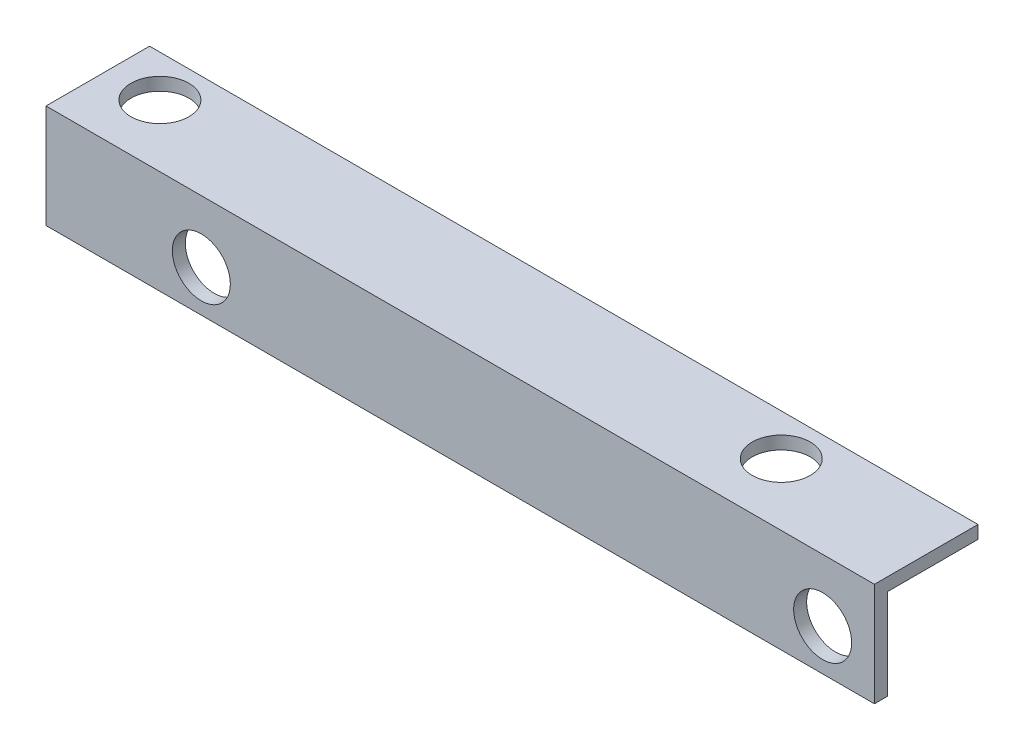
ISO-10303-21;
HEADER;
FILE_DESCRIPTION(('STEP AP214'),'2;1');
FILE_NAME('part.step','',(''),(''),'','','');
FILE_SCHEMA(('AUTOMOTIVE_DESIGN { 1 0 10303 214 1 1 1 1 }'));
ENDSEC;
DATA;
#1=APPLICATION_CONTEXT('core data for automotive mechanical design processes');
#2=APPLICATION_PROTOCOL_DEFINITION('international standard','automotive_design',2000,#1);
#3=PRODUCT_CONTEXT('',#1,'mechanical');
#4=PRODUCT('Part','Part','',(#3));
#5=PRODUCT_RELATED_PRODUCT_CATEGORY('part','',(#4));
#6=PRODUCT_DEFINITION_FORMATION('','',#4);
#7=PRODUCT_DEFINITION_CONTEXT('part definition',#1,'design');
#8=PRODUCT_DEFINITION('design','',#6,#7);
#9=PRODUCT_DEFINITION_SHAPE('','',#8);
#10=(LENGTH_UNIT() NAMED_UNIT(*) SI_UNIT(.MILLI.,.METRE.));
#11=(NAMED_UNIT(*) PLANE_ANGLE_UNIT() SI_UNIT($,.RADIAN.));
#12=(NAMED_UNIT(*) SI_UNIT($,.STERADIAN.) SOLID_ANGLE_UNIT());
#13=UNCERTAINTY_MEASURE_WITH_UNIT(LENGTH_MEASURE(1.E-05),#10,'distance_accuracy_value','');
#14=(GEOMETRIC_REPRESENTATION_CONTEXT(3) GLOBAL_UNCERTAINTY_ASSIGNED_CONTEXT((#13)) GLOBAL_UNIT_ASSIGNED_CONTEXT((#10,
#11,#12)) REPRESENTATION_CONTEXT('',''));
#15=CARTESIAN_POINT('',(0.,0.,0.));
#16=DIRECTION('',(0.,0.,1.));
#17=DIRECTION('',(1.,0.,0.));
#18=AXIS2_PLACEMENT_3D('',#15,#16,#17);
#19=CARTESIAN_POINT('',(-57.15,0.,0.));
#20=DIRECTION('',(0.,-1.,0.));
#21=DIRECTION('',(0.,0.,-1.));
#22=AXIS2_PLACEMENT_3D('',#19,#20,#21);
#23=PLANE('',#22);
#24=DIRECTION('',(1.,0.,0.));
#25=VECTOR('',#24,1.);
#26=CARTESIAN_POINT('',(-57.15,0.,-1.5875));
#27=LINE('',#26,#25);
#28=CARTESIAN_POINT('',(-57.15,0.,-1.5875));
#29=VERTEX_POINT('',#28);
#30=CARTESIAN_POINT('',(44.45,0.,-1.5875));
#31=VERTEX_POINT('',#30);
#32=EDGE_CURVE('E93',#29,#31,#27,.T.);
#33=ORIENTED_EDGE('',*,*,#32,.T.);
#34=DIRECTION('',(0.,0.,-1.));
#35=VECTOR('',#34,1.);
#36=CARTESIAN_POINT('',(44.45,0.,0.));
#37=LINE('',#36,#35);
#38=CARTESIAN_POINT('',(44.45,0.,0.));
#39=VERTEX_POINT('',#38);
#40=EDGE_CURVE('E96',#39,#31,#37,.T.);
#41=ORIENTED_EDGE('',*,*,#40,.F.);
#42=DIRECTION('',(1.,0.,0.));
#43=VECTOR('',#42,1.);
#44=CARTESIAN_POINT('',(-57.15,0.,0.));
#45=LINE('',#44,#43);
#46=CARTESIAN_POINT('',(-57.15,0.,0.));
#47=VERTEX_POINT('',#46);
#48=EDGE_CURVE('E11',#47,#39,#45,.T.);
#49=ORIENTED_EDGE('',*,*,#48,.F.);
#50=DIRECTION('',(0.,0.,-1.));
#51=VECTOR('',#50,1.);
#52=CARTESIAN_POINT('',(-57.15,0.,0.));
#53=LINE('',#52,#51);
#54=EDGE_CURVE('E97',#47,#29,#53,.T.);
#55=ORIENTED_EDGE('',*,*,#54,.T.);
#56=EDGE_LOOP('',(#33,#41,#49,#55));
#57=FACE_BOUND('',#56,.T.);
#58=ADVANCED_FACE('F42',(#57),#23,.T.);
#59=CARTESIAN_POINT('',(-57.15,0.,0.));
#60=DIRECTION('',(0.,0.,1.));
#61=DIRECTION('',(1.,0.,0.));
#62=AXIS2_PLACEMENT_3D('',#59,#60,#61);
#63=PLANE('',#62);
#64=CARTESIAN_POINT('',(-38.1,5.08,0.));
#65=DIRECTION('',(0.,0.,1.));
#66=DIRECTION('',(1.,0.,0.));
#67=AXIS2_PLACEMENT_3D('',#64,#65,#66);
#68=CIRCLE('',#67,3.556);
#69=CARTESIAN_POINT('',(-34.544,5.08,0.));
#70=VERTEX_POINT('',#69);
#71=EDGE_CURVE('E170',#70,#70,#68,.T.);
#72=ORIENTED_EDGE('',*,*,#71,.F.);
#73=EDGE_LOOP('',(#72));
#74=FACE_BOUND('',#73,.T.);
#75=CARTESIAN_POINT('',(38.1,5.08,0.));
#76=DIRECTION('',(0.,0.,1.));
#77=DIRECTION('',(1.,0.,0.));
#78=AXIS2_PLACEMENT_3D('',#75,#76,#77);
#79=CIRCLE('',#78,3.556);
#80=CARTESIAN_POINT('',(41.656,5.08,0.));
#81=VERTEX_POINT('',#80);
#82=EDGE_CURVE('E126',#81,#81,#79,.T.);
#83=ORIENTED_EDGE('',*,*,#82,.F.);
#84=EDGE_LOOP('',(#83));
#85=FACE_BOUND('',#84,.T.);
#86=ORIENTED_EDGE('',*,*,#48,.T.);
#87=DIRECTION('',(0.,-1.,0.));
#88=VECTOR('',#87,1.);
#89=CARTESIAN_POINT('',(44.45,0.,0.));
#90=LINE('',#89,#88);
#91=CARTESIAN_POINT('',(44.45,12.7,0.));
#92=VERTEX_POINT('',#91);
#93=EDGE_CURVE('E117',#92,#39,#90,.T.);
#94=ORIENTED_EDGE('',*,*,#93,.F.);
#95=DIRECTION('',(1.,0.,0.));
#96=VECTOR('',#95,1.);
#97=CARTESIAN_POINT('',(-57.15,12.7,0.));
#98=LINE('',#97,#96);
#99=CARTESIAN_POINT('',(-57.15,12.7,0.));
#100=VERTEX_POINT('',#99);
#101=EDGE_CURVE('E51',#100,#92,#98,.T.);
#102=ORIENTED_EDGE('',*,*,#101,.F.);
#103=DIRECTION('',(0.,-1.,0.));
#104=VECTOR('',#103,1.);
#105=CARTESIAN_POINT('',(-57.15,0.,0.));
#106=LINE('',#105,#104);
#107=EDGE_CURVE('E103',#100,#47,#106,.T.);
#108=ORIENTED_EDGE('',*,*,#107,.T.);
#109=EDGE_LOOP('',(#86,#94,#102,#108));
#110=FACE_BOUND('',#109,.T.);
#111=ADVANCED_FACE('F198',(#74,#85,#110),#63,.T.);
#112=CARTESIAN_POINT('',(-57.15,12.7,0.));
#113=DIRECTION('',(0.,1.,0.));
#114=DIRECTION('',(0.,0.,1.));
#115=AXIS2_PLACEMENT_3D('',#112,#113,#114);
#116=PLANE('',#115);
#117=CARTESIAN_POINT('',(-50.8,12.7,-7.62));
#118=DIRECTION('',(0.,1.,0.));
#119=DIRECTION('',(0.,0.,1.));
#120=AXIS2_PLACEMENT_3D('',#117,#118,#119);
#121=CIRCLE('',#120,3.556);
#122=CARTESIAN_POINT('',(-50.8,12.7,-4.064));
#123=VERTEX_POINT('',#122);
#124=EDGE_CURVE('E174',#123,#123,#121,.T.);
#125=ORIENTED_EDGE('',*,*,#124,.F.);
#126=EDGE_LOOP('',(#125));
#127=FACE_BOUND('',#126,.T.);
#128=CARTESIAN_POINT('',(25.4,12.7,-7.62));
#129=DIRECTION('',(0.,1.,0.));
#130=DIRECTION('',(0.,0.,1.));
#131=AXIS2_PLACEMENT_3D('',#128,#129,#130);
#132=CIRCLE('',#131,3.55600000000001);
#133=CARTESIAN_POINT('',(25.4,12.7,-4.06399999999999));
#134=VERTEX_POINT('',#133);
#135=EDGE_CURVE('E181',#134,#134,#132,.T.);
#136=ORIENTED_EDGE('',*,*,#135,.F.);
#137=EDGE_LOOP('',(#136));
#138=FACE_BOUND('',#137,.T.);
#139=ORIENTED_EDGE('',*,*,#101,.T.);
#140=DIRECTION('',(0.,0.,1.));
#141=VECTOR('',#140,1.);
#142=CARTESIAN_POINT('',(44.45,12.7,0.));
#143=LINE('',#142,#141);
#144=CARTESIAN_POINT('',(44.45,12.7,-12.7));
#145=VERTEX_POINT('',#144);
#146=EDGE_CURVE('E135',#145,#92,#143,.T.);
#147=ORIENTED_EDGE('',*,*,#146,.F.);
#148=DIRECTION('',(1.,0.,0.));
#149=VECTOR('',#148,1.);
#150=CARTESIAN_POINT('',(-57.15,12.7,-12.7));
#151=LINE('',#150,#149);
#152=CARTESIAN_POINT('',(-57.15,12.7,-12.7));
#153=VERTEX_POINT('',#152);
#154=EDGE_CURVE('E160',#153,#145,#151,.T.);
#155=ORIENTED_EDGE('',*,*,#154,.F.);
#156=DIRECTION('',(0.,0.,1.));
#157=VECTOR('',#156,1.);
#158=CARTESIAN_POINT('',(-57.15,12.7,0.));
#159=LINE('',#158,#157);
#160=EDGE_CURVE('E153',#153,#100,#159,.T.);
#161=ORIENTED_EDGE('',*,*,#160,.T.);
#162=EDGE_LOOP('',(#139,#147,#155,#161));
#163=FACE_BOUND('',#162,.T.);
#164=ADVANCED_FACE('F200',(#127,#138,#163),#116,.T.);
#165=CARTESIAN_POINT('',(-57.15,12.7,-12.7));
#166=DIRECTION('',(0.,0.,-1.));
#167=DIRECTION('',(-1.,0.,0.));
#168=AXIS2_PLACEMENT_3D('',#165,#166,#167);
#169=PLANE('',#168);
#170=ORIENTED_EDGE('',*,*,#154,.T.);
#171=DIRECTION('',(0.,1.,0.));
#172=VECTOR('',#171,1.);
#173=CARTESIAN_POINT('',(44.45,12.7,-12.7));
#174=LINE('',#173,#172);
#175=CARTESIAN_POINT('',(44.45,11.1125,-12.7));
#176=VERTEX_POINT('',#175);
#177=EDGE_CURVE('E131',#176,#145,#174,.T.);
#178=ORIENTED_EDGE('',*,*,#177,.F.);
#179=DIRECTION('',(1.,0.,0.));
#180=VECTOR('',#179,1.);
#181=CARTESIAN_POINT('',(-57.15,11.1125,-12.7));
#182=LINE('',#181,#180);
#183=CARTESIAN_POINT('',(-57.15,11.1125,-12.7));
#184=VERTEX_POINT('',#183);
#185=EDGE_CURVE('E163',#184,#176,#182,.T.);
#186=ORIENTED_EDGE('',*,*,#185,.F.);
#187=DIRECTION('',(0.,1.,0.));
#188=VECTOR('',#187,1.);
#189=CARTESIAN_POINT('',(-57.15,12.7,-12.7));
#190=LINE('',#189,#188);
#191=EDGE_CURVE('E149',#184,#153,#190,.T.);
#192=ORIENTED_EDGE('',*,*,#191,.T.);
#193=EDGE_LOOP('',(#170,#178,#186,#192));
#194=FACE_BOUND('',#193,.T.);
#195=ADVANCED_FACE('F214',(#194),#169,.T.);
#196=CARTESIAN_POINT('',(-57.15,11.1125,-1.5875));
#197=DIRECTION('',(0.,-1.,0.));
#198=DIRECTION('',(0.,0.,-1.));
#199=AXIS2_PLACEMENT_3D('',#196,#197,#198);
#200=PLANE('',#199);
#201=CARTESIAN_POINT('',(-50.8,11.1125,-7.62));
#202=DIRECTION('',(0.,-1.,0.));
#203=DIRECTION('',(0.,0.,-1.));
#204=AXIS2_PLACEMENT_3D('',#201,#202,#203);
#205=CIRCLE('',#204,3.556);
#206=CARTESIAN_POINT('',(-50.8,11.1125,-11.176));
#207=VERTEX_POINT('',#206);
#208=EDGE_CURVE('E45',#207,#207,#205,.T.);
#209=ORIENTED_EDGE('',*,*,#208,.F.);
#210=EDGE_LOOP('',(#209));
#211=FACE_BOUND('',#210,.T.);
#212=CARTESIAN_POINT('',(25.4,11.1125,-7.62));
#213=DIRECTION('',(0.,-1.,0.));
#214=DIRECTION('',(0.,0.,-1.));
#215=AXIS2_PLACEMENT_3D('',#212,#213,#214);
#216=CIRCLE('',#215,3.55600000000001);
#217=CARTESIAN_POINT('',(25.4,11.1125,-11.176));
#218=VERTEX_POINT('',#217);
#219=EDGE_CURVE('E171',#218,#218,#216,.T.);
#220=ORIENTED_EDGE('',*,*,#219,.F.);
#221=EDGE_LOOP('',(#220));
#222=FACE_BOUND('',#221,.T.);
#223=ORIENTED_EDGE('',*,*,#185,.T.);
#224=DIRECTION('',(0.,0.,-1.));
#225=VECTOR('',#224,1.);
#226=CARTESIAN_POINT('',(44.45,11.1125,-1.5875));
#227=LINE('',#226,#225);
#228=CARTESIAN_POINT('',(44.45,11.1125,-1.5875));
#229=VERTEX_POINT('',#228);
#230=EDGE_CURVE('E112',#229,#176,#227,.T.);
#231=ORIENTED_EDGE('',*,*,#230,.F.);
#232=DIRECTION('',(1.,0.,0.));
#233=VECTOR('',#232,1.);
#234=CARTESIAN_POINT('',(-57.15,11.1125,-1.5875));
#235=LINE('',#234,#233);
#236=CARTESIAN_POINT('',(-57.15,11.1125,-1.5875));
#237=VERTEX_POINT('',#236);
#238=EDGE_CURVE('E102',#237,#229,#235,.T.);
#239=ORIENTED_EDGE('',*,*,#238,.F.);
#240=DIRECTION('',(0.,0.,-1.));
#241=VECTOR('',#240,1.);
#242=CARTESIAN_POINT('',(-57.15,11.1125,-1.5875));
#243=LINE('',#242,#241);
#244=EDGE_CURVE('E145',#237,#184,#243,.T.);
#245=ORIENTED_EDGE('',*,*,#244,.T.);
#246=EDGE_LOOP('',(#223,#231,#239,#245));
#247=FACE_BOUND('',#246,.T.);
#248=ADVANCED_FACE('F210',(#211,#222,#247),#200,.T.);
#249=CARTESIAN_POINT('',(-57.15,0.,-1.5875));
#250=DIRECTION('',(0.,0.,-1.));
#251=DIRECTION('',(-1.,0.,0.));
#252=AXIS2_PLACEMENT_3D('',#249,#250,#251);
#253=PLANE('',#252);
#254=CARTESIAN_POINT('',(-38.1,5.08,-1.5875));
#255=DIRECTION('',(0.,0.,-1.));
#256=DIRECTION('',(-1.,0.,0.));
#257=AXIS2_PLACEMENT_3D('',#254,#255,#256);
#258=CIRCLE('',#257,3.556);
#259=CARTESIAN_POINT('',(-41.656,5.08,-1.5875));
#260=VERTEX_POINT('',#259);
#261=EDGE_CURVE('E119',#260,#260,#258,.T.);
#262=ORIENTED_EDGE('',*,*,#261,.F.);
#263=EDGE_LOOP('',(#262));
#264=FACE_BOUND('',#263,.T.);
#265=CARTESIAN_POINT('',(38.1,5.08,-1.5875));
#266=DIRECTION('',(0.,0.,-1.));
#267=DIRECTION('',(-1.,0.,0.));
#268=AXIS2_PLACEMENT_3D('',#265,#266,#267);
#269=CIRCLE('',#268,3.556);
#270=CARTESIAN_POINT('',(34.544,5.08,-1.5875));
#271=VERTEX_POINT('',#270);
#272=EDGE_CURVE('E123',#271,#271,#269,.T.);
#273=ORIENTED_EDGE('',*,*,#272,.F.);
#274=EDGE_LOOP('',(#273));
#275=FACE_BOUND('',#274,.T.);
#276=ORIENTED_EDGE('',*,*,#238,.T.);
#277=DIRECTION('',(0.,1.,0.));
#278=VECTOR('',#277,1.);
#279=CARTESIAN_POINT('',(44.45,0.,-1.5875));
#280=LINE('',#279,#278);
#281=EDGE_CURVE('E106',#31,#229,#280,.T.);
#282=ORIENTED_EDGE('',*,*,#281,.F.);
#283=ORIENTED_EDGE('',*,*,#32,.F.);
#284=DIRECTION('',(0.,1.,0.));
#285=VECTOR('',#284,1.);
#286=CARTESIAN_POINT('',(-57.15,0.,-1.5875));
#287=LINE('',#286,#285);
#288=EDGE_CURVE('E142',#29,#237,#287,.T.);
#289=ORIENTED_EDGE('',*,*,#288,.T.);
#290=EDGE_LOOP('',(#276,#282,#283,#289));
#291=FACE_BOUND('',#290,.T.);
#292=ADVANCED_FACE('F107',(#264,#275,#291),#253,.T.);
#293=CARTESIAN_POINT('',(-57.15,0.,0.));
#294=DIRECTION('',(1.,0.,0.));
#295=DIRECTION('',(0.,0.,-1.));
#296=AXIS2_PLACEMENT_3D('',#293,#294,#295);
#297=PLANE('',#296);
#298=ORIENTED_EDGE('',*,*,#54,.F.);
#299=ORIENTED_EDGE('',*,*,#107,.F.);
#300=ORIENTED_EDGE('',*,*,#160,.F.);
#301=ORIENTED_EDGE('',*,*,#191,.F.);
#302=ORIENTED_EDGE('',*,*,#244,.F.);
#303=ORIENTED_EDGE('',*,*,#288,.F.);
#304=EDGE_LOOP('',(#298,#299,#300,#301,#302,#303));
#305=FACE_BOUND('',#304,.T.);
#306=ADVANCED_FACE('F206',(#305),#297,.F.);
#307=CARTESIAN_POINT('',(44.45,0.,0.));
#308=DIRECTION('',(1.,0.,0.));
#309=DIRECTION('',(0.,0.,-1.));
#310=AXIS2_PLACEMENT_3D('',#307,#308,#309);
#311=PLANE('',#310);
#312=ORIENTED_EDGE('',*,*,#40,.T.);
#313=ORIENTED_EDGE('',*,*,#281,.T.);
#314=ORIENTED_EDGE('',*,*,#230,.T.);
#315=ORIENTED_EDGE('',*,*,#177,.T.);
#316=ORIENTED_EDGE('',*,*,#146,.T.);
#317=ORIENTED_EDGE('',*,*,#93,.T.);
#318=EDGE_LOOP('',(#312,#313,#314,#315,#316,#317));
#319=FACE_BOUND('',#318,.T.);
#320=ADVANCED_FACE('F115',(#319),#311,.T.);
#321=CARTESIAN_POINT('',(38.1,5.08,-12.7));
#322=DIRECTION('',(0.,0.,1.));
#323=DIRECTION('',(1.,0.,0.));
#324=AXIS2_PLACEMENT_3D('',#321,#322,#323);
#325=CYLINDRICAL_SURFACE('',#324,3.556);
#326=ORIENTED_EDGE('',*,*,#272,.T.);
#327=EDGE_LOOP('',(#326));
#328=FACE_BOUND('',#327,.T.);
#329=ORIENTED_EDGE('',*,*,#82,.T.);
#330=EDGE_LOOP('',(#329));
#331=FACE_BOUND('',#330,.T.);
#332=ADVANCED_FACE('F196',(#328,#331),#325,.F.);
#333=CARTESIAN_POINT('',(-38.1,5.08,-12.7));
#334=DIRECTION('',(0.,0.,1.));
#335=DIRECTION('',(1.,0.,0.));
#336=AXIS2_PLACEMENT_3D('',#333,#334,#335);
#337=CYLINDRICAL_SURFACE('',#336,3.556);
#338=ORIENTED_EDGE('',*,*,#261,.T.);
#339=EDGE_LOOP('',(#338));
#340=FACE_BOUND('',#339,.T.);
#341=ORIENTED_EDGE('',*,*,#71,.T.);
#342=EDGE_LOOP('',(#341));
#343=FACE_BOUND('',#342,.T.);
#344=ADVANCED_FACE('F276',(#340,#343),#337,.F.);
#345=CARTESIAN_POINT('',(25.4,0.,-7.62));
#346=DIRECTION('',(0.,1.,0.));
#347=DIRECTION('',(0.,0.,1.));
#348=AXIS2_PLACEMENT_3D('',#345,#346,#347);
#349=CYLINDRICAL_SURFACE('',#348,3.55600000000001);
#350=ORIENTED_EDGE('',*,*,#219,.T.);
#351=EDGE_LOOP('',(#350));
#352=FACE_BOUND('',#351,.T.);
#353=ORIENTED_EDGE('',*,*,#135,.T.);
#354=EDGE_LOOP('',(#353));
#355=FACE_BOUND('',#354,.T.);
#356=ADVANCED_FACE('F283',(#352,#355),#349,.F.);
#357=CARTESIAN_POINT('',(-50.8,0.,-7.62));
#358=DIRECTION('',(0.,1.,0.));
#359=DIRECTION('',(0.,0.,1.));
#360=AXIS2_PLACEMENT_3D('',#357,#358,#359);
#361=CYLINDRICAL_SURFACE('',#360,3.556);
#362=ORIENTED_EDGE('',*,*,#208,.T.);
#363=EDGE_LOOP('',(#362));
#364=FACE_BOUND('',#363,.T.);
#365=ORIENTED_EDGE('',*,*,#124,.T.);
#366=EDGE_LOOP('',(#365));
#367=FACE_BOUND('',#366,.T.);
#368=ADVANCED_FACE('F290',(#364,#367),#361,.F.);
#369=CLOSED_SHELL('',(#58,#111,#164,#195,#248,#292,#306,#320,#332,#344,#356,#368));
#370=MANIFOLD_SOLID_BREP('B2',#369);
#371=ADVANCED_BREP_SHAPE_REPRESENTATION('',(#18,#370),#14);
#372=SHAPE_DEFINITION_REPRESENTATION(#9,#371);
ENDSEC;
END-ISO-10303-21;
